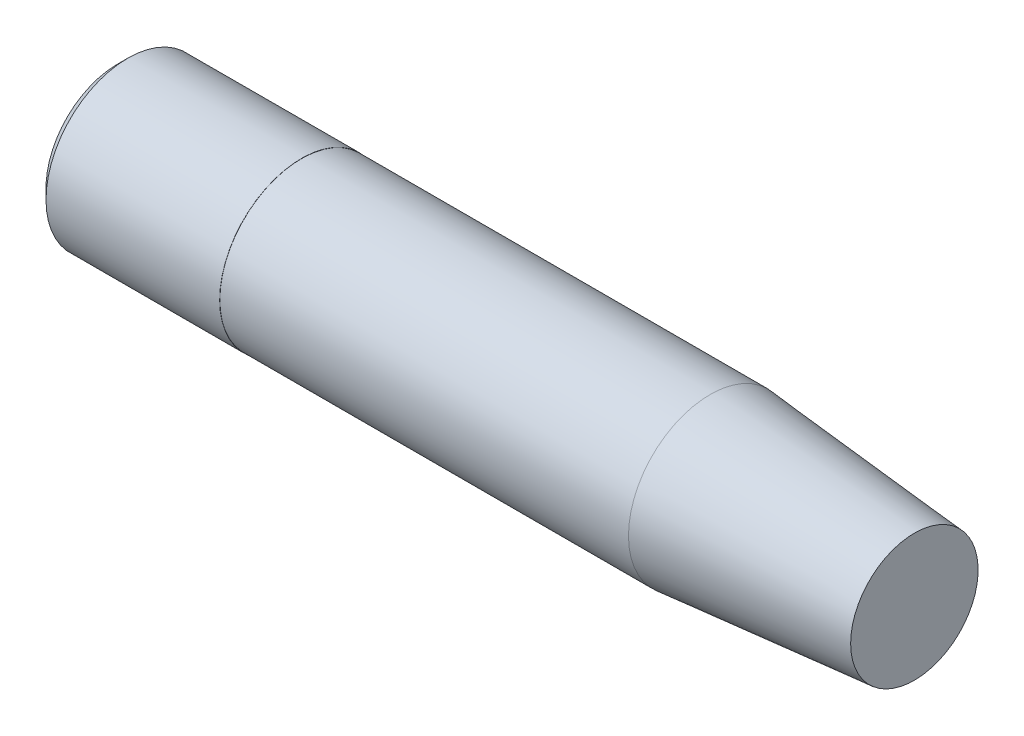
ISO-10303-21;
HEADER;
FILE_DESCRIPTION(('STEP AP214'),'2;1');
FILE_NAME('part.step','',(''),(''),'','','');
FILE_SCHEMA(('AUTOMOTIVE_DESIGN { 1 0 10303 214 1 1 1 1 }'));
ENDSEC;
DATA;
#1=APPLICATION_CONTEXT('core data for automotive mechanical design processes');
#2=APPLICATION_PROTOCOL_DEFINITION('international standard','automotive_design',2000,#1);
#3=PRODUCT_CONTEXT('',#1,'mechanical');
#4=PRODUCT('Part','Part','',(#3));
#5=PRODUCT_RELATED_PRODUCT_CATEGORY('part','',(#4));
#6=PRODUCT_DEFINITION_FORMATION('','',#4);
#7=PRODUCT_DEFINITION_CONTEXT('part definition',#1,'design');
#8=PRODUCT_DEFINITION('design','',#6,#7);
#9=PRODUCT_DEFINITION_SHAPE('','',#8);
#10=(LENGTH_UNIT() NAMED_UNIT(*) SI_UNIT(.MILLI.,.METRE.));
#11=(NAMED_UNIT(*) PLANE_ANGLE_UNIT() SI_UNIT($,.RADIAN.));
#12=(NAMED_UNIT(*) SI_UNIT($,.STERADIAN.) SOLID_ANGLE_UNIT());
#13=UNCERTAINTY_MEASURE_WITH_UNIT(LENGTH_MEASURE(1.E-05),#10,'distance_accuracy_value','');
#14=(GEOMETRIC_REPRESENTATION_CONTEXT(3) GLOBAL_UNCERTAINTY_ASSIGNED_CONTEXT((#13)) GLOBAL_UNIT_ASSIGNED_CONTEXT((#10,
#11,#12)) REPRESENTATION_CONTEXT('',''));
#15=CARTESIAN_POINT('',(0.,0.,0.));
#16=DIRECTION('',(0.,0.,1.));
#17=DIRECTION('',(1.,0.,0.));
#18=AXIS2_PLACEMENT_3D('',#15,#16,#17);
#19=CARTESIAN_POINT('',(19.5,0.,0.));
#20=DIRECTION('',(-1.,0.,0.));
#21=DIRECTION('',(0.,0.,1.));
#22=AXIS2_PLACEMENT_3D('',#19,#20,#21);
#23=PLANE('',#22);
#24=CARTESIAN_POINT('',(19.5,0.,0.));
#25=DIRECTION('',(-1.,0.,0.));
#26=DIRECTION('',(0.,0.,1.));
#27=AXIS2_PLACEMENT_3D('',#24,#25,#26);
#28=CIRCLE('',#27,1.56005668237038);
#29=CARTESIAN_POINT('',(19.5,0.,1.56005668237038));
#30=VERTEX_POINT('',#29);
#31=EDGE_CURVE('E12',#30,#30,#28,.T.);
#32=ORIENTED_EDGE('',*,*,#31,.F.);
#33=EDGE_LOOP('',(#32));
#34=FACE_BOUND('',#33,.T.);
#35=ADVANCED_FACE('F43',(#34),#23,.F.);
#36=CARTESIAN_POINT('',(19.5,0.,0.));
#37=DIRECTION('',(-1.,0.,0.));
#38=DIRECTION('',(0.,0.,1.));
#39=AXIS2_PLACEMENT_3D('',#36,#37,#38);
#40=CONICAL_SURFACE('',#39,1.56005668237038,0.0872664625997163);
#41=CARTESIAN_POINT('',(14.5,0.,0.));
#42=DIRECTION('',(-1.,0.,0.));
#43=DIRECTION('',(0.,0.,1.));
#44=AXIS2_PLACEMENT_3D('',#41,#42,#43);
#45=CIRCLE('',#44,1.9975);
#46=CARTESIAN_POINT('',(14.5,0.,1.9975));
#47=VERTEX_POINT('',#46);
#48=EDGE_CURVE('E49',#47,#47,#45,.T.);
#49=ORIENTED_EDGE('',*,*,#48,.F.);
#50=EDGE_LOOP('',(#49));
#51=FACE_BOUND('',#50,.T.);
#52=ORIENTED_EDGE('',*,*,#31,.T.);
#53=EDGE_LOOP('',(#52));
#54=FACE_BOUND('',#53,.T.);
#55=ADVANCED_FACE('F81',(#51,#54),#40,.T.);
#56=CARTESIAN_POINT('',(-30.1670840436527,0.,0.));
#57=DIRECTION('',(-1.,0.,0.));
#58=DIRECTION('',(0.,0.,1.));
#59=AXIS2_PLACEMENT_3D('',#56,#57,#58);
#60=CYLINDRICAL_SURFACE('',#59,1.9975);
#61=CARTESIAN_POINT('',(4.5,0.,0.));
#62=DIRECTION('',(-1.,0.,0.));
#63=DIRECTION('',(0.,0.,1.));
#64=AXIS2_PLACEMENT_3D('',#61,#62,#63);
#65=CIRCLE('',#64,1.9975);
#66=CARTESIAN_POINT('',(4.5,0.,1.9975));
#67=VERTEX_POINT('',#66);
#68=EDGE_CURVE('E53',#67,#67,#65,.T.);
#69=ORIENTED_EDGE('',*,*,#68,.F.);
#70=EDGE_LOOP('',(#69));
#71=FACE_BOUND('',#70,.T.);
#72=ORIENTED_EDGE('',*,*,#48,.T.);
#73=EDGE_LOOP('',(#72));
#74=FACE_BOUND('',#73,.T.);
#75=ADVANCED_FACE('F86',(#71,#74),#60,.T.);
#76=CARTESIAN_POINT('',(4.5,1.9975,0.));
#77=DIRECTION('',(-1.,0.,0.));
#78=DIRECTION('',(0.,0.,1.));
#79=AXIS2_PLACEMENT_3D('',#76,#77,#78);
#80=PLANE('',#79);
#81=CARTESIAN_POINT('',(4.5,0.,0.));
#82=DIRECTION('',(-1.,0.,0.));
#83=DIRECTION('',(0.,0.,1.));
#84=AXIS2_PLACEMENT_3D('',#81,#82,#83);
#85=CIRCLE('',#84,2.0025);
#86=CARTESIAN_POINT('',(4.5,0.,2.0025));
#87=VERTEX_POINT('',#86);
#88=EDGE_CURVE('E57',#87,#87,#85,.T.);
#89=ORIENTED_EDGE('',*,*,#88,.F.);
#90=EDGE_LOOP('',(#89));
#91=FACE_BOUND('',#90,.T.);
#92=ORIENTED_EDGE('',*,*,#68,.T.);
#93=EDGE_LOOP('',(#92));
#94=FACE_BOUND('',#93,.T.);
#95=ADVANCED_FACE('F91',(#91,#94),#80,.F.);
#96=CARTESIAN_POINT('',(-30.1670840436527,0.,0.));
#97=DIRECTION('',(-1.,0.,0.));
#98=DIRECTION('',(0.,0.,1.));
#99=AXIS2_PLACEMENT_3D('',#96,#97,#98);
#100=CYLINDRICAL_SURFACE('',#99,2.0025);
#101=CARTESIAN_POINT('',(0.25,0.,0.));
#102=DIRECTION('',(1.,0.,0.));
#103=DIRECTION('',(0.,0.,-1.));
#104=AXIS2_PLACEMENT_3D('',#101,#102,#103);
#105=CIRCLE('',#104,2.0025);
#106=CARTESIAN_POINT('',(0.25,0.,-2.0025));
#107=VERTEX_POINT('',#106);
#108=EDGE_CURVE('E62',#107,#107,#105,.T.);
#109=ORIENTED_EDGE('',*,*,#108,.T.);
#110=EDGE_LOOP('',(#109));
#111=FACE_BOUND('',#110,.T.);
#112=ORIENTED_EDGE('',*,*,#88,.T.);
#113=EDGE_LOOP('',(#112));
#114=FACE_BOUND('',#113,.T.);
#115=ADVANCED_FACE('F77',(#111,#114),#100,.T.);
#116=CARTESIAN_POINT('',(0.,0.,0.));
#117=DIRECTION('',(1.,0.,0.));
#118=DIRECTION('',(0.,0.,-1.));
#119=AXIS2_PLACEMENT_3D('',#116,#117,#118);
#120=CONICAL_SURFACE('',#119,1.7525,0.785398163397447);
#121=ORIENTED_EDGE('',*,*,#108,.F.);
#122=EDGE_LOOP('',(#121));
#123=FACE_BOUND('',#122,.T.);
#124=CARTESIAN_POINT('',(0.,0.,0.));
#125=DIRECTION('',(1.,0.,0.));
#126=DIRECTION('',(0.,0.,-1.));
#127=AXIS2_PLACEMENT_3D('',#124,#125,#126);
#128=CIRCLE('',#127,1.7525);
#129=CARTESIAN_POINT('',(0.,0.,-1.7525));
#130=VERTEX_POINT('',#129);
#131=EDGE_CURVE('E65',#130,#130,#128,.T.);
#132=ORIENTED_EDGE('',*,*,#131,.T.);
#133=EDGE_LOOP('',(#132));
#134=FACE_BOUND('',#133,.T.);
#135=ADVANCED_FACE('F69',(#123,#134),#120,.T.);
#136=CARTESIAN_POINT('',(0.,1.7525,0.));
#137=DIRECTION('',(1.,0.,0.));
#138=DIRECTION('',(0.,0.,-1.));
#139=AXIS2_PLACEMENT_3D('',#136,#137,#138);
#140=PLANE('',#139);
#141=ORIENTED_EDGE('',*,*,#131,.F.);
#142=EDGE_LOOP('',(#141));
#143=FACE_BOUND('',#142,.T.);
#144=ADVANCED_FACE('F71',(#143),#140,.F.);
#145=CLOSED_SHELL('',(#35,#55,#75,#95,#115,#135,#144));
#146=MANIFOLD_SOLID_BREP('B2',#145);
#147=ADVANCED_BREP_SHAPE_REPRESENTATION('',(#18,#146),#14);
#148=SHAPE_DEFINITION_REPRESENTATION(#9,#147);
ENDSEC;
END-ISO-10303-21;
